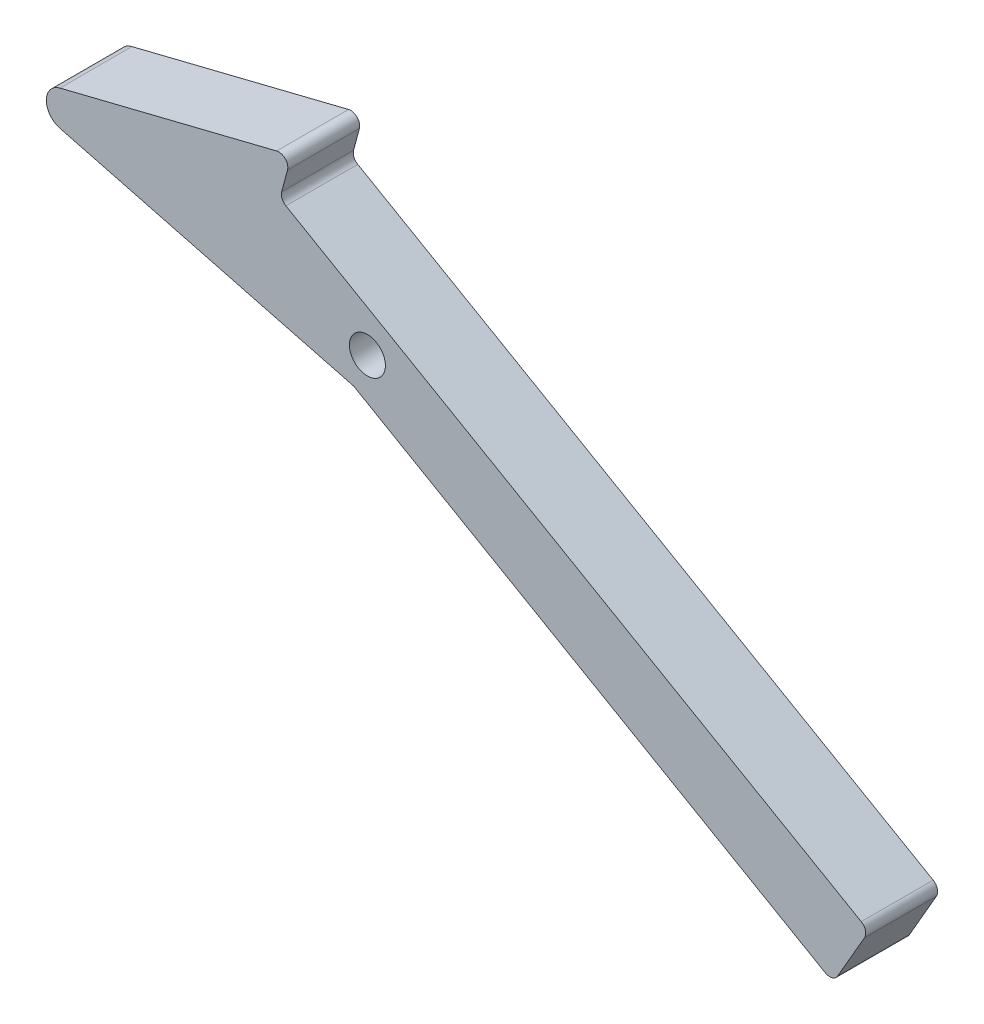
ISO-10303-21;
HEADER;
FILE_DESCRIPTION(('STEP AP214'),'2;1');
FILE_NAME('part.step','',(''),(''),'','','');
FILE_SCHEMA(('AUTOMOTIVE_DESIGN { 1 0 10303 214 1 1 1 1 }'));
ENDSEC;
DATA;
#1=APPLICATION_CONTEXT('core data for automotive mechanical design processes');
#2=APPLICATION_PROTOCOL_DEFINITION('international standard','automotive_design',2000,#1);
#3=PRODUCT_CONTEXT('',#1,'mechanical');
#4=PRODUCT('Part','Part','',(#3));
#5=PRODUCT_RELATED_PRODUCT_CATEGORY('part','',(#4));
#6=PRODUCT_DEFINITION_FORMATION('','',#4);
#7=PRODUCT_DEFINITION_CONTEXT('part definition',#1,'design');
#8=PRODUCT_DEFINITION('design','',#6,#7);
#9=PRODUCT_DEFINITION_SHAPE('','',#8);
#10=(LENGTH_UNIT() NAMED_UNIT(*) SI_UNIT(.MILLI.,.METRE.));
#11=(NAMED_UNIT(*) PLANE_ANGLE_UNIT() SI_UNIT($,.RADIAN.));
#12=(NAMED_UNIT(*) SI_UNIT($,.STERADIAN.) SOLID_ANGLE_UNIT());
#13=UNCERTAINTY_MEASURE_WITH_UNIT(LENGTH_MEASURE(1.E-05),#10,'distance_accuracy_value','');
#14=(GEOMETRIC_REPRESENTATION_CONTEXT(3) GLOBAL_UNCERTAINTY_ASSIGNED_CONTEXT((#13)) GLOBAL_UNIT_ASSIGNED_CONTEXT((#10,
#11,#12)) REPRESENTATION_CONTEXT('',''));
#15=CARTESIAN_POINT('',(0.,0.,0.));
#16=DIRECTION('',(0.,0.,1.));
#17=DIRECTION('',(1.,0.,0.));
#18=AXIS2_PLACEMENT_3D('',#15,#16,#17);
#19=CARTESIAN_POINT('',(1.58749999999999,2.7496306570156,-3.175));
#20=DIRECTION('',(-0.499999999999998,-0.86602540378444,0.));
#21=DIRECTION('',(0.86602540378444,-0.499999999999998,0.));
#22=AXIS2_PLACEMENT_3D('',#19,#20,#21);
#23=PLANE('',#22);
#24=DIRECTION('',(0.86602540378444,-0.499999999999998,0.));
#25=VECTOR('',#24,1.);
#26=CARTESIAN_POINT('',(1.58749999999999,2.7496306570156,3.175));
#27=LINE('',#26,#25);
#28=CARTESIAN_POINT('',(-7.20064251139426,7.82346710164583,3.175));
#29=VERTEX_POINT('',#28);
#30=CARTESIAN_POINT('',(43.6054846420932,-21.5094640869023,3.175));
#31=VERTEX_POINT('',#30);
#32=EDGE_CURVE('E249',#29,#31,#27,.T.);
#33=ORIENTED_EDGE('',*,*,#32,.T.);
#34=DIRECTION('',(0.,0.,1.));
#35=VECTOR('',#34,1.);
#36=CARTESIAN_POINT('',(43.6054846420932,-21.5094640869023,-3.175));
#37=LINE('',#36,#35);
#38=CARTESIAN_POINT('',(43.6054846420932,-21.5094640869023,-3.175));
#39=VERTEX_POINT('',#38);
#40=EDGE_CURVE('E223',#31,#39,#37,.F.);
#41=ORIENTED_EDGE('',*,*,#40,.T.);
#42=DIRECTION('',(0.86602540378444,-0.499999999999998,0.));
#43=VECTOR('',#42,1.);
#44=CARTESIAN_POINT('',(1.58749999999999,2.7496306570156,-3.175));
#45=LINE('',#44,#43);
#46=CARTESIAN_POINT('',(-7.20064251139426,7.82346710164583,-3.175));
#47=VERTEX_POINT('',#46);
#48=EDGE_CURVE('E172',#47,#39,#45,.T.);
#49=ORIENTED_EDGE('',*,*,#48,.F.);
#50=DIRECTION('',(0.,0.,1.));
#51=VECTOR('',#50,1.);
#52=CARTESIAN_POINT('',(-7.20064251139426,7.82346710164583,-3.175));
#53=LINE('',#52,#51);
#54=EDGE_CURVE('E219',#47,#29,#53,.T.);
#55=ORIENTED_EDGE('',*,*,#54,.T.);
#56=EDGE_LOOP('',(#33,#41,#49,#55));
#57=FACE_BOUND('',#56,.T.);
#58=ADVANCED_FACE('F41',(#57),#23,.F.);
#59=CARTESIAN_POINT('',(42.7053923063471,-24.6559697439179,-3.175));
#60=DIRECTION('',(-0.86602540378444,0.499999999999998,0.));
#61=DIRECTION('',(-0.499999999999998,-0.86602540378444,0.));
#62=AXIS2_PLACEMENT_3D('',#59,#60,#61);
#63=PLANE('',#62);
#64=DIRECTION('',(-0.499999999999998,-0.86602540378444,0.));
#65=VECTOR('',#64,1.);
#66=CARTESIAN_POINT('',(42.7053923063471,-24.6559697439179,-3.175));
#67=LINE('',#66,#65);
#68=CARTESIAN_POINT('',(43.8960173063471,-22.5937467511562,-3.175));
#69=VERTEX_POINT('',#68);
#70=CARTESIAN_POINT('',(41.5147673063471,-26.7181927366796,-3.175));
#71=VERTEX_POINT('',#70);
#72=EDGE_CURVE('E191',#69,#71,#67,.T.);
#73=ORIENTED_EDGE('',*,*,#72,.F.);
#74=DIRECTION('',(0.,0.,1.));
#75=VECTOR('',#74,1.);
#76=CARTESIAN_POINT('',(43.8960173063471,-22.5937467511562,-3.175));
#77=LINE('',#76,#75);
#78=CARTESIAN_POINT('',(43.8960173063471,-22.5937467511562,3.175));
#79=VERTEX_POINT('',#78);
#80=EDGE_CURVE('E207',#69,#79,#77,.T.);
#81=ORIENTED_EDGE('',*,*,#80,.T.);
#82=DIRECTION('',(-0.499999999999998,-0.86602540378444,0.));
#83=VECTOR('',#82,1.);
#84=CARTESIAN_POINT('',(42.7053923063471,-24.6559697439179,3.175));
#85=LINE('',#84,#83);
#86=CARTESIAN_POINT('',(41.5147673063471,-26.7181927366796,3.175));
#87=VERTEX_POINT('',#86);
#88=EDGE_CURVE('E164',#79,#87,#85,.T.);
#89=ORIENTED_EDGE('',*,*,#88,.T.);
#90=DIRECTION('',(0.,0.,1.));
#91=VECTOR('',#90,1.);
#92=CARTESIAN_POINT('',(41.5147673063471,-26.7181927366796,-3.175));
#93=LINE('',#92,#91);
#94=EDGE_CURVE('E202',#87,#71,#93,.F.);
#95=ORIENTED_EDGE('',*,*,#94,.T.);
#96=EDGE_LOOP('',(#73,#81,#89,#95));
#97=FACE_BOUND('',#96,.T.);
#98=ADVANCED_FACE('F269',(#97),#63,.F.);
#99=CARTESIAN_POINT('',(-1.58749999999999,-2.74963065701558,-3.175));
#100=DIRECTION('',(0.499999999999998,0.866025403784439,0.));
#101=DIRECTION('',(-0.86602540378444,0.499999999999998,0.));
#102=AXIS2_PLACEMENT_3D('',#99,#100,#101);
#103=PLANE('',#102);
#104=DIRECTION('',(-0.86602540378444,0.499999999999998,0.));
#105=VECTOR('',#104,1.);
#106=CARTESIAN_POINT('',(-1.58749999999999,-2.74963065701558,-3.175));
#107=LINE('',#106,#105);
#108=CARTESIAN_POINT('',(40.4304846420932,-27.0087254009335,-3.175));
#109=VERTEX_POINT('',#108);
#110=CARTESIAN_POINT('',(-1.21507831394484,-2.96464841771157,-3.175));
#111=VERTEX_POINT('',#110);
#112=EDGE_CURVE('E188',#109,#111,#107,.T.);
#113=ORIENTED_EDGE('',*,*,#112,.F.);
#114=DIRECTION('',(0.,0.,1.));
#115=VECTOR('',#114,1.);
#116=CARTESIAN_POINT('',(40.4304846420932,-27.0087254009335,-3.175));
#117=LINE('',#116,#115);
#118=CARTESIAN_POINT('',(40.4304846420932,-27.0087254009335,3.175));
#119=VERTEX_POINT('',#118);
#120=EDGE_CURVE('E234',#109,#119,#117,.T.);
#121=ORIENTED_EDGE('',*,*,#120,.T.);
#122=DIRECTION('',(-0.86602540378444,0.499999999999998,0.));
#123=VECTOR('',#122,1.);
#124=CARTESIAN_POINT('',(-1.58749999999999,-2.74963065701558,3.175));
#125=LINE('',#124,#123);
#126=CARTESIAN_POINT('',(-1.21507831394484,-2.96464841771157,3.175));
#127=VERTEX_POINT('',#126);
#128=EDGE_CURVE('E158',#119,#127,#125,.T.);
#129=ORIENTED_EDGE('',*,*,#128,.T.);
#130=DIRECTION('',(0.,0.,1.));
#131=VECTOR('',#130,1.);
#132=CARTESIAN_POINT('',(-1.21507831394484,-2.96464841771157,-3.175));
#133=LINE('',#132,#131);
#134=EDGE_CURVE('E198',#111,#127,#133,.T.);
#135=ORIENTED_EDGE('',*,*,#134,.F.);
#136=EDGE_LOOP('',(#113,#121,#129,#135));
#137=FACE_BOUND('',#136,.T.);
#138=ADVANCED_FACE('F278',(#137),#103,.F.);
#139=CARTESIAN_POINT('',(-0.79887816906418,-3.07285187911696,-3.175));
#140=DIRECTION('',(-0.251615171358797,-0.967827363501406,0.));
#141=DIRECTION('',(0.967827363501406,-0.251615171358797,0.));
#142=AXIS2_PLACEMENT_3D('',#139,#140,#141);
#143=PLANE('',#142);
#144=ORIENTED_EDGE('',*,*,#134,.T.);
#145=DIRECTION('',(0.967827363501406,-0.251615171358797,0.));
#146=VECTOR('',#145,1.);
#147=CARTESIAN_POINT('',(-0.79887816906418,-3.07285187911696,3.175));
#148=LINE('',#147,#146);
#149=CARTESIAN_POINT('',(-27.1617476790787,3.7809509574488,3.175));
#150=VERTEX_POINT('',#149);
#151=EDGE_CURVE('E155',#150,#127,#148,.T.);
#152=ORIENTED_EDGE('',*,*,#151,.F.);
#153=DIRECTION('',(0.,0.,1.));
#154=VECTOR('',#153,1.);
#155=CARTESIAN_POINT('',(-27.1617476790787,3.7809509574488,-3.175));
#156=LINE('',#155,#154);
#157=CARTESIAN_POINT('',(-27.1617476790787,3.7809509574488,-3.175));
#158=VERTEX_POINT('',#157);
#159=EDGE_CURVE('E150',#158,#150,#156,.T.);
#160=ORIENTED_EDGE('',*,*,#159,.F.);
#161=DIRECTION('',(0.967827363501406,-0.251615171358797,0.));
#162=VECTOR('',#161,1.);
#163=CARTESIAN_POINT('',(-0.79887816906418,-3.07285187911696,-3.175));
#164=LINE('',#163,#162);
#165=EDGE_CURVE('E184',#158,#111,#164,.T.);
#166=ORIENTED_EDGE('',*,*,#165,.T.);
#167=EDGE_LOOP('',(#144,#152,#160,#166));
#168=FACE_BOUND('',#167,.T.);
#169=ADVANCED_FACE('F281',(#168),#143,.T.);
#170=CARTESIAN_POINT('',(-26.7623085945466,5.31737689700728,-3.175));
#171=DIRECTION('',(0.,0.,1.));
#172=DIRECTION('',(1.,0.,0.));
#173=AXIS2_PLACEMENT_3D('',#170,#171,#172);
#174=CYLINDRICAL_SURFACE('',#173,1.5875);
#175=ORIENTED_EDGE('',*,*,#159,.T.);
#176=CARTESIAN_POINT('',(-26.7623085945466,5.31737689700728,3.175));
#177=DIRECTION('',(0.,0.,1.));
#178=DIRECTION('',(1.,0.,0.));
#179=AXIS2_PLACEMENT_3D('',#176,#177,#178);
#180=CIRCLE('',#179,1.5875);
#181=CARTESIAN_POINT('',(-27.1452403176058,6.858,3.175));
#182=VERTEX_POINT('',#181);
#183=EDGE_CURVE('E133',#182,#150,#180,.T.);
#184=ORIENTED_EDGE('',*,*,#183,.F.);
#185=DIRECTION('',(0.,0.,1.));
#186=VECTOR('',#185,1.);
#187=CARTESIAN_POINT('',(-27.1452403176058,6.858,-3.175));
#188=LINE('',#187,#186);
#189=CARTESIAN_POINT('',(-27.1452403176058,6.858,-3.175));
#190=VERTEX_POINT('',#189);
#191=EDGE_CURVE('E143',#190,#182,#188,.T.);
#192=ORIENTED_EDGE('',*,*,#191,.F.);
#193=CARTESIAN_POINT('',(-26.7623085945466,5.31737689700728,-3.175));
#194=DIRECTION('',(0.,0.,1.));
#195=DIRECTION('',(1.,0.,0.));
#196=AXIS2_PLACEMENT_3D('',#193,#194,#195);
#197=CIRCLE('',#196,1.5875);
#198=EDGE_CURVE('E181',#190,#158,#197,.T.);
#199=ORIENTED_EDGE('',*,*,#198,.T.);
#200=EDGE_LOOP('',(#175,#184,#192,#199));
#201=FACE_BOUND('',#200,.T.);
#202=ADVANCED_FACE('F153',(#201),#174,.T.);
#203=CARTESIAN_POINT('',(-3.18487768699857,12.8135013354261,-3.175));
#204=DIRECTION('',(-0.241216833423114,0.970471245979666,0.));
#205=DIRECTION('',(-0.970471245979666,-0.241216833423114,0.));
#206=AXIS2_PLACEMENT_3D('',#203,#204,#205);
#207=PLANE('',#206);
#208=DIRECTION('',(-0.970471245979666,-0.241216833423114,0.));
#209=VECTOR('',#208,1.);
#210=CARTESIAN_POINT('',(-3.18487768699857,12.8135013354261,3.175));
#211=LINE('',#210,#209);
#212=CARTESIAN_POINT('',(-8.01386633941935,11.6132253291059,3.175));
#213=VERTEX_POINT('',#212);
#214=EDGE_CURVE('E126',#213,#182,#211,.T.);
#215=ORIENTED_EDGE('',*,*,#214,.F.);
#216=DIRECTION('',(0.,0.,1.));
#217=VECTOR('',#216,1.);
#218=CARTESIAN_POINT('',(-8.01386633941935,11.6132253291059,-3.175));
#219=LINE('',#218,#217);
#220=CARTESIAN_POINT('',(-8.01386633941935,11.6132253291059,-3.175));
#221=VERTEX_POINT('',#220);
#222=EDGE_CURVE('E244',#213,#221,#219,.F.);
#223=ORIENTED_EDGE('',*,*,#222,.T.);
#224=DIRECTION('',(-0.970471245979666,-0.241216833423114,0.));
#225=VECTOR('',#224,1.);
#226=CARTESIAN_POINT('',(-3.18487768699857,12.8135013354261,-3.175));
#227=LINE('',#226,#225);
#228=EDGE_CURVE('E145',#221,#190,#227,.T.);
#229=ORIENTED_EDGE('',*,*,#228,.T.);
#230=ORIENTED_EDGE('',*,*,#191,.T.);
#231=EDGE_LOOP('',(#215,#223,#229,#230));
#232=FACE_BOUND('',#231,.T.);
#233=ADVANCED_FACE('F144',(#232),#207,.T.);
#234=CARTESIAN_POINT('',(-9.24242382494432,2.47649999999995,-3.175));
#235=DIRECTION('',(0.965925826289069,-0.258819045102516,0.));
#236=DIRECTION('',(0.258819045102516,0.96592582628907,0.));
#237=AXIS2_PLACEMENT_3D('',#234,#235,#236);
#238=PLANE('',#237);
#239=DIRECTION('',(0.258819045102516,0.96592582628907,0.));
#240=VECTOR('',#239,1.);
#241=CARTESIAN_POINT('',(-9.24242382494432,2.47649999999995,3.175));
#242=LINE('',#241,#240);
#243=CARTESIAN_POINT('',(-7.5704711360112,8.71631238294985,3.175));
#244=VERTEX_POINT('',#243);
#245=CARTESIAN_POINT('',(-7.0556968532728,10.6374761605594,3.175));
#246=VERTEX_POINT('',#245);
#247=EDGE_CURVE('E140',#244,#246,#242,.T.);
#248=ORIENTED_EDGE('',*,*,#247,.F.);
#249=DIRECTION('',(0.,0.,1.));
#250=VECTOR('',#249,1.);
#251=CARTESIAN_POINT('',(-7.5704711360112,8.71631238294985,-3.175));
#252=LINE('',#251,#250);
#253=CARTESIAN_POINT('',(-7.5704711360112,8.71631238294985,-3.175));
#254=VERTEX_POINT('',#253);
#255=EDGE_CURVE('E64',#244,#254,#252,.F.);
#256=ORIENTED_EDGE('',*,*,#255,.T.);
#257=DIRECTION('',(0.258819045102516,0.96592582628907,0.));
#258=VECTOR('',#257,1.);
#259=CARTESIAN_POINT('',(-9.24242382494432,2.47649999999995,-3.175));
#260=LINE('',#259,#258);
#261=CARTESIAN_POINT('',(-7.0556968532728,10.6374761605594,-3.175));
#262=VERTEX_POINT('',#261);
#263=EDGE_CURVE('E176',#254,#262,#260,.T.);
#264=ORIENTED_EDGE('',*,*,#263,.T.);
#265=DIRECTION('',(0.,0.,1.));
#266=VECTOR('',#265,1.);
#267=CARTESIAN_POINT('',(-7.0556968532728,10.6374761605594,-3.175));
#268=LINE('',#267,#266);
#269=EDGE_CURVE('E238',#262,#246,#268,.T.);
#270=ORIENTED_EDGE('',*,*,#269,.T.);
#271=EDGE_LOOP('',(#248,#256,#264,#270));
#272=FACE_BOUND('',#271,.T.);
#273=ADVANCED_FACE('F252',(#272),#238,.T.);
#274=CARTESIAN_POINT('',(0.,0.,-3.175));
#275=DIRECTION('',(0.,0.,1.));
#276=DIRECTION('',(1.,0.,0.));
#277=AXIS2_PLACEMENT_3D('',#274,#275,#276);
#278=CYLINDRICAL_SURFACE('',#277,1.5875);
#279=CARTESIAN_POINT('',(0.,0.,-3.175));
#280=DIRECTION('',(0.,0.,1.));
#281=DIRECTION('',(1.,0.,0.));
#282=AXIS2_PLACEMENT_3D('',#279,#280,#281);
#283=CIRCLE('',#282,1.5875);
#284=CARTESIAN_POINT('',(1.5875,0.,-3.175));
#285=VERTEX_POINT('',#284);
#286=EDGE_CURVE('E151',#285,#285,#283,.T.);
#287=ORIENTED_EDGE('',*,*,#286,.F.);
#288=EDGE_LOOP('',(#287));
#289=FACE_BOUND('',#288,.T.);
#290=CARTESIAN_POINT('',(0.,0.,3.175));
#291=DIRECTION('',(0.,0.,1.));
#292=DIRECTION('',(1.,0.,0.));
#293=AXIS2_PLACEMENT_3D('',#290,#291,#292);
#294=CIRCLE('',#293,1.5875);
#295=CARTESIAN_POINT('',(1.5875,0.,3.175));
#296=VERTEX_POINT('',#295);
#297=EDGE_CURVE('E168',#296,#296,#294,.T.);
#298=ORIENTED_EDGE('',*,*,#297,.T.);
#299=EDGE_LOOP('',(#298));
#300=FACE_BOUND('',#299,.T.);
#301=ADVANCED_FACE('F337',(#289,#300),#278,.F.);
#302=CARTESIAN_POINT('',(0.,0.,-3.175));
#303=DIRECTION('',(0.,0.,1.));
#304=DIRECTION('',(1.,0.,0.));
#305=AXIS2_PLACEMENT_3D('',#302,#303,#304);
#306=PLANE('',#305);
#307=ORIENTED_EDGE('',*,*,#48,.T.);
#308=CARTESIAN_POINT('',(43.2086096420932,-22.1968717511562,-3.175));
#309=DIRECTION('',(0.,0.,1.));
#310=DIRECTION('',(1.,0.,0.));
#311=AXIS2_PLACEMENT_3D('',#308,#309,#310);
#312=CIRCLE('',#311,0.79375);
#313=EDGE_CURVE('E231',#39,#69,#312,.F.);
#314=ORIENTED_EDGE('',*,*,#313,.T.);
#315=ORIENTED_EDGE('',*,*,#72,.T.);
#316=CARTESIAN_POINT('',(40.8273596420932,-26.3213177366796,-3.175));
#317=DIRECTION('',(0.,0.,1.));
#318=DIRECTION('',(1.,0.,0.));
#319=AXIS2_PLACEMENT_3D('',#316,#317,#318);
#320=CIRCLE('',#319,0.79375);
#321=EDGE_CURVE('E228',#71,#109,#320,.F.);
#322=ORIENTED_EDGE('',*,*,#321,.T.);
#323=ORIENTED_EDGE('',*,*,#112,.T.);
#324=ORIENTED_EDGE('',*,*,#165,.F.);
#325=ORIENTED_EDGE('',*,*,#198,.F.);
#326=ORIENTED_EDGE('',*,*,#228,.F.);
#327=CARTESIAN_POINT('',(-7.82240047788975,10.8429137776096,-3.175));
#328=DIRECTION('',(0.,0.,1.));
#329=DIRECTION('',(1.,0.,0.));
#330=AXIS2_PLACEMENT_3D('',#327,#328,#329);
#331=CIRCLE('',#330,0.79375);
#332=EDGE_CURVE('E57',#221,#262,#331,.F.);
#333=ORIENTED_EDGE('',*,*,#332,.T.);
#334=ORIENTED_EDGE('',*,*,#263,.F.);
#335=CARTESIAN_POINT('',(-6.80376751139426,8.51087476589973,-3.175));
#336=DIRECTION('',(0.,0.,1.));
#337=DIRECTION('',(1.,0.,0.));
#338=AXIS2_PLACEMENT_3D('',#335,#336,#337);
#339=CIRCLE('',#338,0.79375);
#340=EDGE_CURVE('E11',#254,#47,#339,.T.);
#341=ORIENTED_EDGE('',*,*,#340,.T.);
#342=EDGE_LOOP('',(#307,#314,#315,#322,#323,#324,#325,#326,#333,#334,#341));
#343=FACE_BOUND('',#342,.T.);
#344=ORIENTED_EDGE('',*,*,#286,.T.);
#345=EDGE_LOOP('',(#344));
#346=FACE_BOUND('',#345,.T.);
#347=ADVANCED_FACE('F258',(#343,#346),#306,.F.);
#348=CARTESIAN_POINT('',(0.,0.,3.175));
#349=DIRECTION('',(0.,0.,1.));
#350=DIRECTION('',(1.,0.,0.));
#351=AXIS2_PLACEMENT_3D('',#348,#349,#350);
#352=PLANE('',#351);
#353=ORIENTED_EDGE('',*,*,#88,.F.);
#354=CARTESIAN_POINT('',(43.2086096420932,-22.1968717511562,3.175));
#355=DIRECTION('',(0.,0.,1.));
#356=DIRECTION('',(1.,0.,0.));
#357=AXIS2_PLACEMENT_3D('',#354,#355,#356);
#358=CIRCLE('',#357,0.79375);
#359=EDGE_CURVE('E216',#79,#31,#358,.T.);
#360=ORIENTED_EDGE('',*,*,#359,.T.);
#361=ORIENTED_EDGE('',*,*,#32,.F.);
#362=CARTESIAN_POINT('',(-6.80376751139426,8.51087476589973,3.175));
#363=DIRECTION('',(0.,0.,1.));
#364=DIRECTION('',(1.,0.,0.));
#365=AXIS2_PLACEMENT_3D('',#362,#363,#364);
#366=CIRCLE('',#365,0.79375);
#367=EDGE_CURVE('E50',#29,#244,#366,.F.);
#368=ORIENTED_EDGE('',*,*,#367,.T.);
#369=ORIENTED_EDGE('',*,*,#247,.T.);
#370=CARTESIAN_POINT('',(-7.82240047788975,10.8429137776096,3.175));
#371=DIRECTION('',(0.,0.,1.));
#372=DIRECTION('',(1.,0.,0.));
#373=AXIS2_PLACEMENT_3D('',#370,#371,#372);
#374=CIRCLE('',#373,0.79375);
#375=EDGE_CURVE('E136',#246,#213,#374,.T.);
#376=ORIENTED_EDGE('',*,*,#375,.T.);
#377=ORIENTED_EDGE('',*,*,#214,.T.);
#378=ORIENTED_EDGE('',*,*,#183,.T.);
#379=ORIENTED_EDGE('',*,*,#151,.T.);
#380=ORIENTED_EDGE('',*,*,#128,.F.);
#381=CARTESIAN_POINT('',(40.8273596420932,-26.3213177366796,3.175));
#382=DIRECTION('',(0.,0.,1.));
#383=DIRECTION('',(1.,0.,0.));
#384=AXIS2_PLACEMENT_3D('',#381,#382,#383);
#385=CIRCLE('',#384,0.79375);
#386=EDGE_CURVE('E213',#119,#87,#385,.T.);
#387=ORIENTED_EDGE('',*,*,#386,.T.);
#388=EDGE_LOOP('',(#353,#360,#361,#368,#369,#376,#377,#378,#379,#380,#387));
#389=FACE_BOUND('',#388,.T.);
#390=ORIENTED_EDGE('',*,*,#297,.F.);
#391=EDGE_LOOP('',(#390));
#392=FACE_BOUND('',#391,.T.);
#393=ADVANCED_FACE('F129',(#389,#392),#352,.T.);
#394=CARTESIAN_POINT('',(43.2086096420932,-22.1968717511562,-3.175));
#395=DIRECTION('',(0.,0.,1.));
#396=DIRECTION('',(1.,0.,0.));
#397=AXIS2_PLACEMENT_3D('',#394,#395,#396);
#398=CYLINDRICAL_SURFACE('',#397,0.79375);
#399=ORIENTED_EDGE('',*,*,#313,.F.);
#400=ORIENTED_EDGE('',*,*,#40,.F.);
#401=ORIENTED_EDGE('',*,*,#359,.F.);
#402=ORIENTED_EDGE('',*,*,#80,.F.);
#403=EDGE_LOOP('',(#399,#400,#401,#402));
#404=FACE_BOUND('',#403,.T.);
#405=ADVANCED_FACE('F264',(#404),#398,.T.);
#406=CARTESIAN_POINT('',(40.8273596420932,-26.3213177366796,-3.175));
#407=DIRECTION('',(0.,0.,1.));
#408=DIRECTION('',(1.,0.,0.));
#409=AXIS2_PLACEMENT_3D('',#406,#407,#408);
#410=CYLINDRICAL_SURFACE('',#409,0.79375);
#411=ORIENTED_EDGE('',*,*,#321,.F.);
#412=ORIENTED_EDGE('',*,*,#94,.F.);
#413=ORIENTED_EDGE('',*,*,#386,.F.);
#414=ORIENTED_EDGE('',*,*,#120,.F.);
#415=EDGE_LOOP('',(#411,#412,#413,#414));
#416=FACE_BOUND('',#415,.T.);
#417=ADVANCED_FACE('F272',(#416),#410,.T.);
#418=CARTESIAN_POINT('',(-6.80376751139426,8.51087476589973,-3.175));
#419=DIRECTION('',(0.,0.,1.));
#420=DIRECTION('',(1.,0.,0.));
#421=AXIS2_PLACEMENT_3D('',#418,#419,#420);
#422=CYLINDRICAL_SURFACE('',#421,0.79375);
#423=ORIENTED_EDGE('',*,*,#340,.F.);
#424=ORIENTED_EDGE('',*,*,#255,.F.);
#425=ORIENTED_EDGE('',*,*,#367,.F.);
#426=ORIENTED_EDGE('',*,*,#54,.F.);
#427=EDGE_LOOP('',(#423,#424,#425,#426));
#428=FACE_BOUND('',#427,.T.);
#429=ADVANCED_FACE('F256',(#428),#422,.F.);
#430=CARTESIAN_POINT('',(-7.82240047788975,10.8429137776096,-3.175));
#431=DIRECTION('',(0.,0.,1.));
#432=DIRECTION('',(1.,0.,0.));
#433=AXIS2_PLACEMENT_3D('',#430,#431,#432);
#434=CYLINDRICAL_SURFACE('',#433,0.79375);
#435=ORIENTED_EDGE('',*,*,#332,.F.);
#436=ORIENTED_EDGE('',*,*,#222,.F.);
#437=ORIENTED_EDGE('',*,*,#375,.F.);
#438=ORIENTED_EDGE('',*,*,#269,.F.);
#439=EDGE_LOOP('',(#435,#436,#437,#438));
#440=FACE_BOUND('',#439,.T.);
#441=ADVANCED_FACE('F43',(#440),#434,.T.);
#442=CLOSED_SHELL('',(#58,#98,#138,#169,#202,#233,#273,#301,#347,#393,#405,#417,#429,#441));
#443=MANIFOLD_SOLID_BREP('B2',#442);
#444=ADVANCED_BREP_SHAPE_REPRESENTATION('',(#18,#443),#14);
#445=SHAPE_DEFINITION_REPRESENTATION(#9,#444);
ENDSEC;
END-ISO-10303-21;
